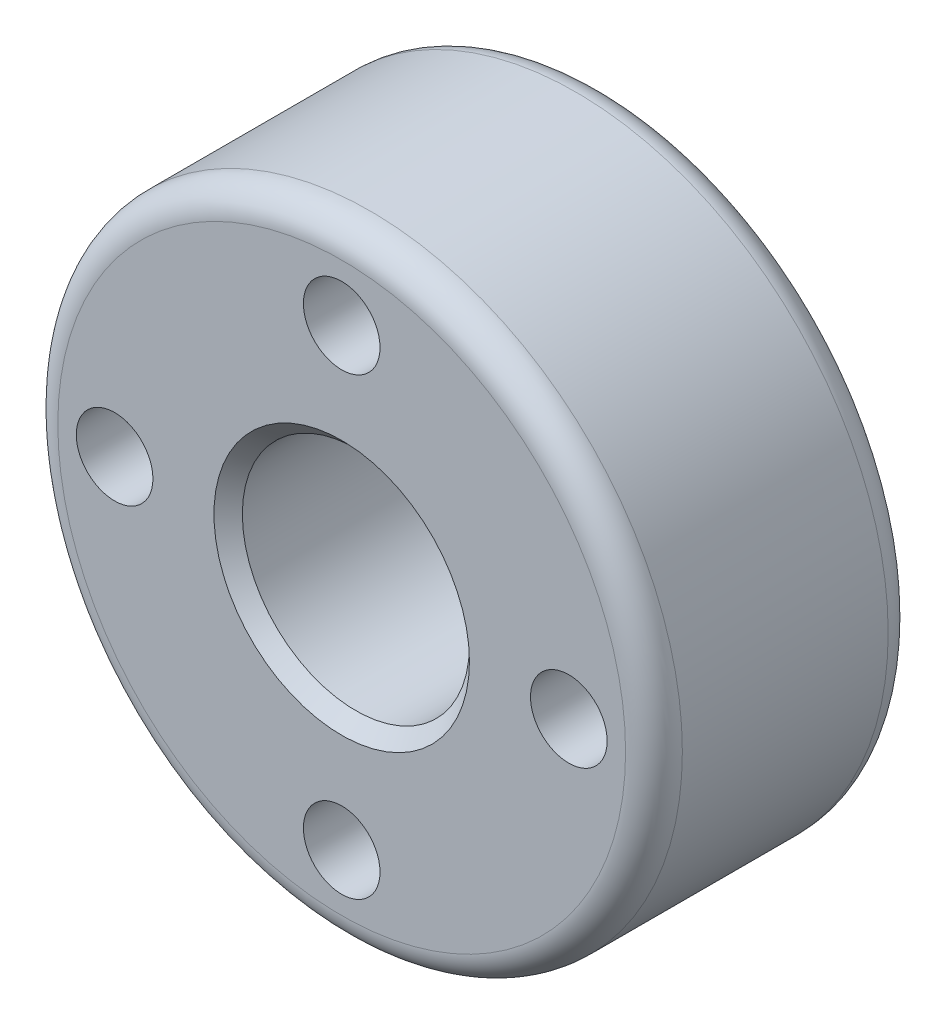
ISO-10303-21;
HEADER;
FILE_DESCRIPTION(('STEP AP214'),'2;1');
FILE_NAME('part.step','',(''),(''),'','','');
FILE_SCHEMA(('AUTOMOTIVE_DESIGN { 1 0 10303 214 1 1 1 1 }'));
ENDSEC;
DATA;
#1=APPLICATION_CONTEXT('core data for automotive mechanical design processes');
#2=APPLICATION_PROTOCOL_DEFINITION('international standard','automotive_design',2000,#1);
#3=PRODUCT_CONTEXT('',#1,'mechanical');
#4=PRODUCT('Part','Part','',(#3));
#5=PRODUCT_RELATED_PRODUCT_CATEGORY('part','',(#4));
#6=PRODUCT_DEFINITION_FORMATION('','',#4);
#7=PRODUCT_DEFINITION_CONTEXT('part definition',#1,'design');
#8=PRODUCT_DEFINITION('design','',#6,#7);
#9=PRODUCT_DEFINITION_SHAPE('','',#8);
#10=(LENGTH_UNIT() NAMED_UNIT(*) SI_UNIT(.MILLI.,.METRE.));
#11=(NAMED_UNIT(*) PLANE_ANGLE_UNIT() SI_UNIT($,.RADIAN.));
#12=(NAMED_UNIT(*) SI_UNIT($,.STERADIAN.) SOLID_ANGLE_UNIT());
#13=UNCERTAINTY_MEASURE_WITH_UNIT(LENGTH_MEASURE(1.E-05),#10,'distance_accuracy_value','');
#14=(GEOMETRIC_REPRESENTATION_CONTEXT(3) GLOBAL_UNCERTAINTY_ASSIGNED_CONTEXT((#13)) GLOBAL_UNIT_ASSIGNED_CONTEXT((#10,
#11,#12)) REPRESENTATION_CONTEXT('',''));
#15=CARTESIAN_POINT('',(0.,0.,0.));
#16=DIRECTION('',(0.,0.,1.));
#17=DIRECTION('',(1.,0.,0.));
#18=AXIS2_PLACEMENT_3D('',#15,#16,#17);
#19=CARTESIAN_POINT('',(0.,0.,-9.25));
#20=DIRECTION('',(0.,0.,1.));
#21=DIRECTION('',(1.,0.,0.));
#22=AXIS2_PLACEMENT_3D('',#19,#20,#21);
#23=CYLINDRICAL_SURFACE('',#22,4.);
#24=CARTESIAN_POINT('',(0.,0.,-0.499999999988177));
#25=DIRECTION('',(0.,0.,1.));
#26=DIRECTION('',(1.,0.,0.));
#27=AXIS2_PLACEMENT_3D('',#24,#25,#26);
#28=CIRCLE('',#27,3.99999999996226);
#29=CARTESIAN_POINT('',(3.99999999996226,0.,-0.499999999988177));
#30=VERTEX_POINT('',#29);
#31=EDGE_CURVE('E253',#30,#30,#28,.T.);
#32=ORIENTED_EDGE('',*,*,#31,.T.);
#33=EDGE_LOOP('',(#32));
#34=FACE_BOUND('',#33,.T.);
#35=CARTESIAN_POINT('',(0.,0.,-8.74999999996362));
#36=DIRECTION('',(0.,0.,-1.));
#37=DIRECTION('',(-1.,0.,0.));
#38=AXIS2_PLACEMENT_3D('',#35,#36,#37);
#39=CIRCLE('',#38,3.99999999996226);
#40=CARTESIAN_POINT('',(-3.99999999996226,0.,-8.74999999996362));
#41=VERTEX_POINT('',#40);
#42=EDGE_CURVE('E256',#41,#41,#39,.T.);
#43=ORIENTED_EDGE('',*,*,#42,.T.);
#44=EDGE_LOOP('',(#43));
#45=FACE_BOUND('',#44,.T.);
#46=ADVANCED_FACE('F15',(#34,#45),#23,.F.);
#47=CARTESIAN_POINT('',(0.,0.,-9.24999999989495));
#48=DIRECTION('',(0.,0.,-1.));
#49=DIRECTION('',(-1.,0.,0.));
#50=AXIS2_PLACEMENT_3D('',#47,#48,#49);
#51=CONICAL_SURFACE('',#50,4.49999999989359,0.785398163397448);
#52=CARTESIAN_POINT('',(0.,0.,-9.2499999999518));
#53=DIRECTION('',(0.,0.,-1.));
#54=DIRECTION('',(-1.,0.,0.));
#55=AXIS2_PLACEMENT_3D('',#52,#53,#54);
#56=CIRCLE('',#55,4.49999999995043);
#57=CARTESIAN_POINT('',(-4.49999999995043,0.,-9.2499999999518));
#58=VERTEX_POINT('',#57);
#59=EDGE_CURVE('E259',#58,#58,#56,.T.);
#60=ORIENTED_EDGE('',*,*,#59,.T.);
#61=EDGE_LOOP('',(#60));
#62=FACE_BOUND('',#61,.T.);
#63=ORIENTED_EDGE('',*,*,#42,.F.);
#64=EDGE_LOOP('',(#63));
#65=FACE_BOUND('',#64,.T.);
#66=ADVANCED_FACE('F218',(#62,#65),#51,.F.);
#67=CARTESIAN_POINT('',(0.,0.,-1.13686837721616E-10));
#68=DIRECTION('',(0.,0.,1.));
#69=DIRECTION('',(1.,0.,0.));
#70=AXIS2_PLACEMENT_3D('',#67,#68,#69);
#71=CONICAL_SURFACE('',#70,4.49999999989359,0.785398163454292);
#72=ORIENTED_EDGE('',*,*,#31,.F.);
#73=EDGE_LOOP('',(#72));
#74=FACE_BOUND('',#73,.T.);
#75=CARTESIAN_POINT('',(0.,0.,-5.68434188672704E-11));
#76=DIRECTION('',(0.,0.,1.));
#77=DIRECTION('',(1.,0.,0.));
#78=AXIS2_PLACEMENT_3D('',#75,#76,#77);
#79=CIRCLE('',#78,4.49999999995043);
#80=CARTESIAN_POINT('',(4.49999999995043,0.,-5.68434188672704E-11));
#81=VERTEX_POINT('',#80);
#82=EDGE_CURVE('E274',#81,#81,#79,.F.);
#83=ORIENTED_EDGE('',*,*,#82,.F.);
#84=EDGE_LOOP('',(#83));
#85=FACE_BOUND('',#84,.T.);
#86=ADVANCED_FACE('F207',(#74,#85),#71,.F.);
#87=CARTESIAN_POINT('',(0.,8.,-9.25));
#88=DIRECTION('',(0.,0.,1.));
#89=DIRECTION('',(1.,0.,0.));
#90=AXIS2_PLACEMENT_3D('',#87,#88,#89);
#91=CYLINDRICAL_SURFACE('',#90,1.35);
#92=CARTESIAN_POINT('',(0.,8.,0.));
#93=DIRECTION('',(0.,0.,1.));
#94=DIRECTION('',(1.,0.,0.));
#95=AXIS2_PLACEMENT_3D('',#92,#93,#94);
#96=CIRCLE('',#95,1.35);
#97=CARTESIAN_POINT('',(1.35,8.,0.));
#98=VERTEX_POINT('',#97);
#99=EDGE_CURVE('E271',#98,#98,#96,.F.);
#100=ORIENTED_EDGE('',*,*,#99,.F.);
#101=EDGE_LOOP('',(#100));
#102=FACE_BOUND('',#101,.T.);
#103=CARTESIAN_POINT('',(0.,8.,-9.25));
#104=DIRECTION('',(0.,0.,1.));
#105=DIRECTION('',(1.,0.,0.));
#106=AXIS2_PLACEMENT_3D('',#103,#104,#105);
#107=CIRCLE('',#106,1.35);
#108=CARTESIAN_POINT('',(1.35,8.,-9.25));
#109=VERTEX_POINT('',#108);
#110=EDGE_CURVE('E285',#109,#109,#107,.F.);
#111=ORIENTED_EDGE('',*,*,#110,.T.);
#112=EDGE_LOOP('',(#111));
#113=FACE_BOUND('',#112,.T.);
#114=ADVANCED_FACE('F196',(#102,#113),#91,.F.);
#115=CARTESIAN_POINT('',(0.,-8.,-9.25));
#116=DIRECTION('',(0.,0.,1.));
#117=DIRECTION('',(1.,0.,0.));
#118=AXIS2_PLACEMENT_3D('',#115,#116,#117);
#119=CYLINDRICAL_SURFACE('',#118,1.35);
#120=CARTESIAN_POINT('',(0.,-8.,0.));
#121=DIRECTION('',(0.,0.,1.));
#122=DIRECTION('',(1.,0.,0.));
#123=AXIS2_PLACEMENT_3D('',#120,#121,#122);
#124=CIRCLE('',#123,1.35);
#125=CARTESIAN_POINT('',(1.35,-8.,0.));
#126=VERTEX_POINT('',#125);
#127=EDGE_CURVE('E268',#126,#126,#124,.F.);
#128=ORIENTED_EDGE('',*,*,#127,.F.);
#129=EDGE_LOOP('',(#128));
#130=FACE_BOUND('',#129,.T.);
#131=CARTESIAN_POINT('',(0.,-8.,-9.25));
#132=DIRECTION('',(0.,0.,1.));
#133=DIRECTION('',(1.,0.,0.));
#134=AXIS2_PLACEMENT_3D('',#131,#132,#133);
#135=CIRCLE('',#134,1.35);
#136=CARTESIAN_POINT('',(1.35,-8.,-9.25));
#137=VERTEX_POINT('',#136);
#138=EDGE_CURVE('E282',#137,#137,#135,.F.);
#139=ORIENTED_EDGE('',*,*,#138,.T.);
#140=EDGE_LOOP('',(#139));
#141=FACE_BOUND('',#140,.T.);
#142=ADVANCED_FACE('F185',(#130,#141),#119,.F.);
#143=CARTESIAN_POINT('',(-8.,0.,-9.25));
#144=DIRECTION('',(0.,0.,1.));
#145=DIRECTION('',(1.,0.,0.));
#146=AXIS2_PLACEMENT_3D('',#143,#144,#145);
#147=CYLINDRICAL_SURFACE('',#146,1.35);
#148=CARTESIAN_POINT('',(-8.,0.,0.));
#149=DIRECTION('',(0.,0.,1.));
#150=DIRECTION('',(1.,0.,0.));
#151=AXIS2_PLACEMENT_3D('',#148,#149,#150);
#152=CIRCLE('',#151,1.35);
#153=CARTESIAN_POINT('',(-6.65,0.,0.));
#154=VERTEX_POINT('',#153);
#155=EDGE_CURVE('E265',#154,#154,#152,.F.);
#156=ORIENTED_EDGE('',*,*,#155,.F.);
#157=EDGE_LOOP('',(#156));
#158=FACE_BOUND('',#157,.T.);
#159=CARTESIAN_POINT('',(-8.,0.,-9.25));
#160=DIRECTION('',(0.,0.,1.));
#161=DIRECTION('',(1.,0.,0.));
#162=AXIS2_PLACEMENT_3D('',#159,#160,#161);
#163=CIRCLE('',#162,1.35);
#164=CARTESIAN_POINT('',(-6.65,0.,-9.25));
#165=VERTEX_POINT('',#164);
#166=EDGE_CURVE('E279',#165,#165,#163,.F.);
#167=ORIENTED_EDGE('',*,*,#166,.T.);
#168=EDGE_LOOP('',(#167));
#169=FACE_BOUND('',#168,.T.);
#170=ADVANCED_FACE('F175',(#158,#169),#147,.F.);
#171=CARTESIAN_POINT('',(8.,0.,-9.25));
#172=DIRECTION('',(0.,0.,1.));
#173=DIRECTION('',(1.,0.,0.));
#174=AXIS2_PLACEMENT_3D('',#171,#172,#173);
#175=CYLINDRICAL_SURFACE('',#174,1.35);
#176=CARTESIAN_POINT('',(8.,0.,0.));
#177=DIRECTION('',(0.,0.,1.));
#178=DIRECTION('',(1.,0.,0.));
#179=AXIS2_PLACEMENT_3D('',#176,#177,#178);
#180=CIRCLE('',#179,1.35);
#181=CARTESIAN_POINT('',(9.35,0.,0.));
#182=VERTEX_POINT('',#181);
#183=EDGE_CURVE('E57',#182,#182,#180,.F.);
#184=ORIENTED_EDGE('',*,*,#183,.F.);
#185=EDGE_LOOP('',(#184));
#186=FACE_BOUND('',#185,.T.);
#187=CARTESIAN_POINT('',(8.,0.,-9.25));
#188=DIRECTION('',(0.,0.,1.));
#189=DIRECTION('',(1.,0.,0.));
#190=AXIS2_PLACEMENT_3D('',#187,#188,#189);
#191=CIRCLE('',#190,1.35);
#192=CARTESIAN_POINT('',(9.35,0.,-9.25));
#193=VERTEX_POINT('',#192);
#194=EDGE_CURVE('E50',#193,#193,#191,.F.);
#195=ORIENTED_EDGE('',*,*,#194,.T.);
#196=EDGE_LOOP('',(#195));
#197=FACE_BOUND('',#196,.T.);
#198=ADVANCED_FACE('F166',(#186,#197),#175,.F.);
#199=CARTESIAN_POINT('',(0.,0.,-9.25));
#200=DIRECTION('',(0.,0.,1.));
#201=DIRECTION('',(1.,0.,0.));
#202=AXIS2_PLACEMENT_3D('',#199,#200,#201);
#203=PLANE('',#202);
#204=ORIENTED_EDGE('',*,*,#194,.F.);
#205=EDGE_LOOP('',(#204));
#206=FACE_BOUND('',#205,.T.);
#207=ORIENTED_EDGE('',*,*,#166,.F.);
#208=EDGE_LOOP('',(#207));
#209=FACE_BOUND('',#208,.T.);
#210=ORIENTED_EDGE('',*,*,#138,.F.);
#211=EDGE_LOOP('',(#210));
#212=FACE_BOUND('',#211,.T.);
#213=ORIENTED_EDGE('',*,*,#110,.F.);
#214=EDGE_LOOP('',(#213));
#215=FACE_BOUND('',#214,.T.);
#216=ORIENTED_EDGE('',*,*,#59,.F.);
#217=EDGE_LOOP('',(#216));
#218=FACE_BOUND('',#217,.T.);
#219=CARTESIAN_POINT('',(0.,0.,-9.25));
#220=DIRECTION('',(0.,0.,1.));
#221=DIRECTION('',(-1.,0.,0.));
#222=AXIS2_PLACEMENT_3D('',#219,#220,#221);
#223=CIRCLE('',#222,10.);
#224=CARTESIAN_POINT('',(-10.,0.,-9.25));
#225=VERTEX_POINT('',#224);
#226=CARTESIAN_POINT('',(10.,0.,-9.25));
#227=VERTEX_POINT('',#226);
#228=EDGE_CURVE('E43',#225,#227,#223,.T.);
#229=ORIENTED_EDGE('',*,*,#228,.F.);
#230=CARTESIAN_POINT('',(0.,0.,-9.25));
#231=DIRECTION('',(0.,0.,1.));
#232=DIRECTION('',(1.,0.,0.));
#233=AXIS2_PLACEMENT_3D('',#230,#231,#232);
#234=CIRCLE('',#233,10.);
#235=EDGE_CURVE('E48',#227,#225,#234,.T.);
#236=ORIENTED_EDGE('',*,*,#235,.F.);
#237=EDGE_LOOP('',(#229,#236));
#238=FACE_BOUND('',#237,.T.);
#239=ADVANCED_FACE('F47',(#206,#209,#212,#215,#218,#238),#203,.F.);
#240=CARTESIAN_POINT('',(0.,0.,0.));
#241=DIRECTION('',(0.,0.,1.));
#242=DIRECTION('',(1.,0.,0.));
#243=AXIS2_PLACEMENT_3D('',#240,#241,#242);
#244=PLANE('',#243);
#245=ORIENTED_EDGE('',*,*,#183,.T.);
#246=EDGE_LOOP('',(#245));
#247=FACE_BOUND('',#246,.T.);
#248=ORIENTED_EDGE('',*,*,#155,.T.);
#249=EDGE_LOOP('',(#248));
#250=FACE_BOUND('',#249,.T.);
#251=ORIENTED_EDGE('',*,*,#127,.T.);
#252=EDGE_LOOP('',(#251));
#253=FACE_BOUND('',#252,.T.);
#254=ORIENTED_EDGE('',*,*,#99,.T.);
#255=EDGE_LOOP('',(#254));
#256=FACE_BOUND('',#255,.T.);
#257=ORIENTED_EDGE('',*,*,#82,.T.);
#258=EDGE_LOOP('',(#257));
#259=FACE_BOUND('',#258,.T.);
#260=CARTESIAN_POINT('',(0.,0.,0.));
#261=DIRECTION('',(0.,0.,-1.));
#262=DIRECTION('',(1.,0.,0.));
#263=AXIS2_PLACEMENT_3D('',#260,#261,#262);
#264=CIRCLE('',#263,10.);
#265=CARTESIAN_POINT('',(-10.,0.,0.));
#266=VERTEX_POINT('',#265);
#267=CARTESIAN_POINT('',(10.,0.,0.));
#268=VERTEX_POINT('',#267);
#269=EDGE_CURVE('E34',#266,#268,#264,.F.);
#270=ORIENTED_EDGE('',*,*,#269,.T.);
#271=CARTESIAN_POINT('',(0.,0.,0.));
#272=DIRECTION('',(0.,0.,-1.));
#273=DIRECTION('',(-1.,0.,0.));
#274=AXIS2_PLACEMENT_3D('',#271,#272,#273);
#275=CIRCLE('',#274,10.);
#276=EDGE_CURVE('E56',#266,#268,#275,.T.);
#277=ORIENTED_EDGE('',*,*,#276,.F.);
#278=EDGE_LOOP('',(#270,#277));
#279=FACE_BOUND('',#278,.T.);
#280=ADVANCED_FACE('F77',(#247,#250,#253,#256,#259,#279),#244,.T.);
#281=CARTESIAN_POINT('',(0.,0.,-8.25));
#282=DIRECTION('',(0.,0.,1.));
#283=DIRECTION('',(1.,0.,0.));
#284=AXIS2_PLACEMENT_3D('',#281,#282,#283);
#285=TOROIDAL_SURFACE('',#284,10.,1.);
#286=ORIENTED_EDGE('',*,*,#228,.T.);
#287=ORIENTED_EDGE('',*,*,#235,.T.);
#288=EDGE_LOOP('',(#286,#287));
#289=FACE_BOUND('',#288,.T.);
#290=CARTESIAN_POINT('',(0.,0.,-8.25));
#291=DIRECTION('',(0.,0.,1.));
#292=DIRECTION('',(1.,0.,0.));
#293=AXIS2_PLACEMENT_3D('',#290,#291,#292);
#294=CIRCLE('',#293,11.);
#295=CARTESIAN_POINT('',(11.,0.,-8.25));
#296=VERTEX_POINT('',#295);
#297=EDGE_CURVE('E26',#296,#296,#294,.T.);
#298=ORIENTED_EDGE('',*,*,#297,.F.);
#299=EDGE_LOOP('',(#298));
#300=FACE_BOUND('',#299,.T.);
#301=ADVANCED_FACE('F54',(#289,#300),#285,.T.);
#302=CARTESIAN_POINT('',(0.,0.,-1.));
#303=DIRECTION('',(0.,0.,1.));
#304=DIRECTION('',(1.,0.,0.));
#305=AXIS2_PLACEMENT_3D('',#302,#303,#304);
#306=TOROIDAL_SURFACE('',#305,10.,1.);
#307=ORIENTED_EDGE('',*,*,#276,.T.);
#308=ORIENTED_EDGE('',*,*,#269,.F.);
#309=EDGE_LOOP('',(#307,#308));
#310=FACE_BOUND('',#309,.T.);
#311=CARTESIAN_POINT('',(0.,0.,-1.));
#312=DIRECTION('',(0.,0.,1.));
#313=DIRECTION('',(1.,0.,0.));
#314=AXIS2_PLACEMENT_3D('',#311,#312,#313);
#315=CIRCLE('',#314,11.);
#316=CARTESIAN_POINT('',(11.,0.,-1.));
#317=VERTEX_POINT('',#316);
#318=EDGE_CURVE('E10',#317,#317,#315,.F.);
#319=ORIENTED_EDGE('',*,*,#318,.F.);
#320=EDGE_LOOP('',(#319));
#321=FACE_BOUND('',#320,.T.);
#322=ADVANCED_FACE('F76',(#310,#321),#306,.T.);
#323=CARTESIAN_POINT('',(0.,0.,-9.25));
#324=DIRECTION('',(0.,0.,1.));
#325=DIRECTION('',(1.,0.,0.));
#326=AXIS2_PLACEMENT_3D('',#323,#324,#325);
#327=CYLINDRICAL_SURFACE('',#326,11.);
#328=ORIENTED_EDGE('',*,*,#297,.T.);
#329=EDGE_LOOP('',(#328));
#330=FACE_BOUND('',#329,.T.);
#331=ORIENTED_EDGE('',*,*,#318,.T.);
#332=EDGE_LOOP('',(#331));
#333=FACE_BOUND('',#332,.T.);
#334=ADVANCED_FACE('F108',(#330,#333),#327,.T.);
#335=CLOSED_SHELL('',(#46,#66,#86,#114,#142,#170,#198,#239,#280,#301,#322,#334));
#336=MANIFOLD_SOLID_BREP('B1',#335);
#337=ADVANCED_BREP_SHAPE_REPRESENTATION('',(#18,#336),#14);
#338=SHAPE_DEFINITION_REPRESENTATION(#9,#337);
ENDSEC;
END-ISO-10303-21;
